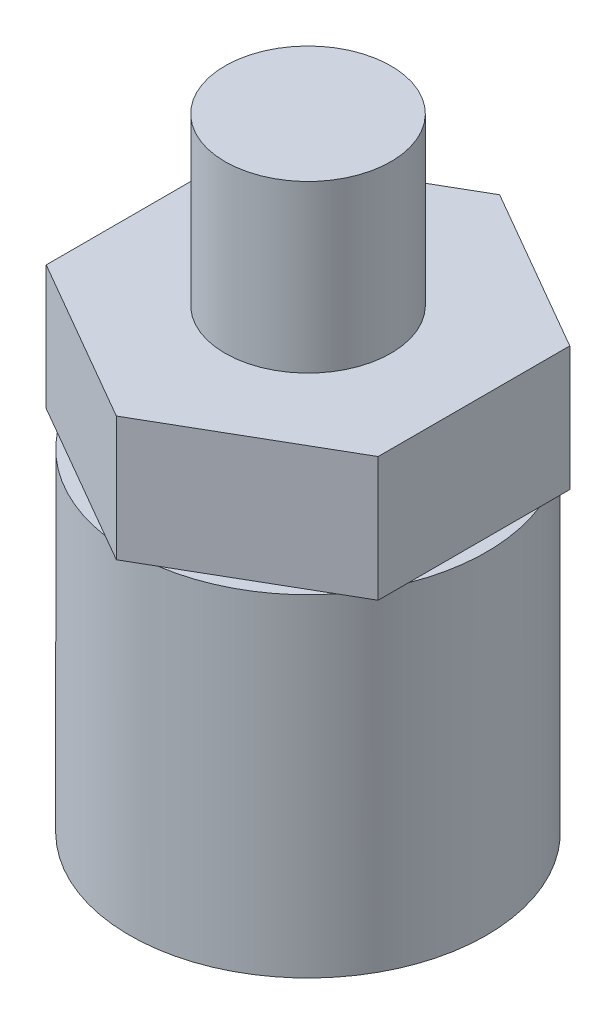
ISO-10303-21;
HEADER;
FILE_DESCRIPTION(('STEP AP214'),'2;1');
FILE_NAME('part.step','',(''),(''),'','','');
FILE_SCHEMA(('AUTOMOTIVE_DESIGN { 1 0 10303 214 1 1 1 1 }'));
ENDSEC;
DATA;
#1=APPLICATION_CONTEXT('core data for automotive mechanical design processes');
#2=APPLICATION_PROTOCOL_DEFINITION('international standard','automotive_design',2000,#1);
#3=PRODUCT_CONTEXT('',#1,'mechanical');
#4=PRODUCT('Part','Part','',(#3));
#5=PRODUCT_RELATED_PRODUCT_CATEGORY('part','',(#4));
#6=PRODUCT_DEFINITION_FORMATION('','',#4);
#7=PRODUCT_DEFINITION_CONTEXT('part definition',#1,'design');
#8=PRODUCT_DEFINITION('design','',#6,#7);
#9=PRODUCT_DEFINITION_SHAPE('','',#8);
#10=(LENGTH_UNIT() NAMED_UNIT(*) SI_UNIT(.MILLI.,.METRE.));
#11=(NAMED_UNIT(*) PLANE_ANGLE_UNIT() SI_UNIT($,.RADIAN.));
#12=(NAMED_UNIT(*) SI_UNIT($,.STERADIAN.) SOLID_ANGLE_UNIT());
#13=UNCERTAINTY_MEASURE_WITH_UNIT(LENGTH_MEASURE(1.E-05),#10,'distance_accuracy_value','');
#14=(GEOMETRIC_REPRESENTATION_CONTEXT(3) GLOBAL_UNCERTAINTY_ASSIGNED_CONTEXT((#13)) GLOBAL_UNIT_ASSIGNED_CONTEXT((#10,
#11,#12)) REPRESENTATION_CONTEXT('',''));
#15=CARTESIAN_POINT('',(0.,0.,0.));
#16=DIRECTION('',(0.,0.,1.));
#17=DIRECTION('',(1.,0.,0.));
#18=AXIS2_PLACEMENT_3D('',#15,#16,#17);
#19=CARTESIAN_POINT('',(0.,0.,0.));
#20=DIRECTION('',(0.,1.,0.));
#21=DIRECTION('',(0.,0.,1.));
#22=AXIS2_PLACEMENT_3D('',#19,#20,#21);
#23=PLANE('',#22);
#24=CARTESIAN_POINT('',(0.,0.,0.));
#25=DIRECTION('',(0.,-1.,0.));
#26=DIRECTION('',(0.,0.,-1.));
#27=AXIS2_PLACEMENT_3D('',#24,#25,#26);
#28=CIRCLE('',#27,4.3);
#29=CARTESIAN_POINT('',(3.36656503687163,0.,-2.6751149232348));
#30=VERTEX_POINT('',#29);
#31=CARTESIAN_POINT('',(4.,0.,-1.57797338380596));
#32=VERTEX_POINT('',#31);
#33=EDGE_CURVE('E41',#30,#32,#28,.T.);
#34=ORIENTED_EDGE('',*,*,#33,.F.);
#35=DIRECTION('',(-0.866025403784441,0.,-0.499999999999995));
#36=VECTOR('',#35,1.);
#37=CARTESIAN_POINT('',(3.99999999999999,0.,-2.30940107675852));
#38=LINE('',#37,#36);
#39=CARTESIAN_POINT('',(3.99999999999999,0.,-2.30940107675852));
#40=VERTEX_POINT('',#39);
#41=EDGE_CURVE('E132',#40,#30,#38,.T.);
#42=ORIENTED_EDGE('',*,*,#41,.F.);
#43=DIRECTION('',(0.,0.,-1.));
#44=VECTOR('',#43,1.);
#45=CARTESIAN_POINT('',(4.00000000000001,0.,2.3094010767585));
#46=LINE('',#45,#44);
#47=EDGE_CURVE('E226',#32,#40,#46,.T.);
#48=ORIENTED_EDGE('',*,*,#47,.F.);
#49=EDGE_LOOP('',(#34,#42,#48));
#50=FACE_BOUND('',#49,.T.);
#51=ADVANCED_FACE('F32',(#50),#23,.F.);
#52=CARTESIAN_POINT('',(4.00000000000001,0.,1.57797338380593));
#53=VERTEX_POINT('',#52);
#54=CARTESIAN_POINT('',(3.36656503687165,0.,2.67511492323478));
#55=VERTEX_POINT('',#54);
#56=EDGE_CURVE('E259',#53,#55,#28,.T.);
#57=ORIENTED_EDGE('',*,*,#56,.F.);
#58=CARTESIAN_POINT('',(4.00000000000001,0.,2.3094010767585));
#59=VERTEX_POINT('',#58);
#60=EDGE_CURVE('E144',#59,#53,#46,.T.);
#61=ORIENTED_EDGE('',*,*,#60,.F.);
#62=DIRECTION('',(0.866025403784438,0.,-0.500000000000001));
#63=VECTOR('',#62,1.);
#64=CARTESIAN_POINT('',(0.,0.,4.61880215351701));
#65=LINE('',#64,#63);
#66=EDGE_CURVE('E49',#55,#59,#65,.T.);
#67=ORIENTED_EDGE('',*,*,#66,.F.);
#68=EDGE_LOOP('',(#57,#61,#67));
#69=FACE_BOUND('',#68,.T.);
#70=ADVANCED_FACE('F279',(#69),#23,.F.);
#71=CARTESIAN_POINT('',(0.633434963128365,0.,4.25308830704073));
#72=VERTEX_POINT('',#71);
#73=CARTESIAN_POINT('',(-0.633434963128376,0.,4.25308830704073));
#74=VERTEX_POINT('',#73);
#75=EDGE_CURVE('E57',#72,#74,#28,.T.);
#76=ORIENTED_EDGE('',*,*,#75,.F.);
#77=CARTESIAN_POINT('',(0.,0.,4.61880215351701));
#78=VERTEX_POINT('',#77);
#79=EDGE_CURVE('E227',#78,#72,#65,.T.);
#80=ORIENTED_EDGE('',*,*,#79,.F.);
#81=DIRECTION('',(0.866025403784442,0.,0.499999999999995));
#82=VECTOR('',#81,1.);
#83=CARTESIAN_POINT('',(-3.99999999999998,0.,2.30940107675855));
#84=LINE('',#83,#82);
#85=EDGE_CURVE('E159',#74,#78,#84,.T.);
#86=ORIENTED_EDGE('',*,*,#85,.F.);
#87=EDGE_LOOP('',(#76,#80,#86));
#88=FACE_BOUND('',#87,.T.);
#89=ADVANCED_FACE('F285',(#88),#23,.F.);
#90=CARTESIAN_POINT('',(-3.3665650368716,0.,2.67511492323484));
#91=VERTEX_POINT('',#90);
#92=CARTESIAN_POINT('',(-3.99999999999999,0.,1.57797338380599));
#93=VERTEX_POINT('',#92);
#94=EDGE_CURVE('E257',#91,#93,#28,.T.);
#95=ORIENTED_EDGE('',*,*,#94,.F.);
#96=CARTESIAN_POINT('',(-3.99999999999998,0.,2.30940107675855));
#97=VERTEX_POINT('',#96);
#98=EDGE_CURVE('E230',#97,#91,#84,.T.);
#99=ORIENTED_EDGE('',*,*,#98,.F.);
#100=DIRECTION('',(0.,0.,1.));
#101=VECTOR('',#100,1.);
#102=CARTESIAN_POINT('',(-4.00000000000002,0.,-2.30940107675847));
#103=LINE('',#102,#101);
#104=EDGE_CURVE('E220',#93,#97,#103,.T.);
#105=ORIENTED_EDGE('',*,*,#104,.F.);
#106=EDGE_LOOP('',(#95,#99,#105));
#107=FACE_BOUND('',#106,.T.);
#108=ADVANCED_FACE('F255',(#107),#23,.F.);
#109=CARTESIAN_POINT('',(-4.00000000000002,0.,-1.5779733838059));
#110=VERTEX_POINT('',#109);
#111=CARTESIAN_POINT('',(-3.36656503687167,0.,-2.67511492323475));
#112=VERTEX_POINT('',#111);
#113=EDGE_CURVE('E153',#110,#112,#28,.T.);
#114=ORIENTED_EDGE('',*,*,#113,.F.);
#115=CARTESIAN_POINT('',(-4.00000000000002,0.,-2.30940107675847));
#116=VERTEX_POINT('',#115);
#117=EDGE_CURVE('E197',#116,#110,#103,.T.);
#118=ORIENTED_EDGE('',*,*,#117,.F.);
#119=DIRECTION('',(-0.866025403784434,0.,0.500000000000007));
#120=VECTOR('',#119,1.);
#121=CARTESIAN_POINT('',(0.,0.,-4.61880215351701));
#122=LINE('',#121,#120);
#123=EDGE_CURVE('E222',#112,#116,#122,.T.);
#124=ORIENTED_EDGE('',*,*,#123,.F.);
#125=EDGE_LOOP('',(#114,#118,#124));
#126=FACE_BOUND('',#125,.T.);
#127=ADVANCED_FACE('F262',(#126),#23,.F.);
#128=CARTESIAN_POINT('',(-3.99999999999998,3.,2.30940107675855));
#129=DIRECTION('',(0.499999999999995,0.,-0.866025403784441));
#130=DIRECTION('',(-0.866025403784442,0.,-0.499999999999995));
#131=AXIS2_PLACEMENT_3D('',#128,#129,#130);
#132=PLANE('',#131);
#133=ORIENTED_EDGE('',*,*,#98,.T.);
#134=EDGE_CURVE('E232',#91,#74,#84,.T.);
#135=ORIENTED_EDGE('',*,*,#134,.T.);
#136=ORIENTED_EDGE('',*,*,#85,.T.);
#137=DIRECTION('',(0.,-1.,0.));
#138=VECTOR('',#137,1.);
#139=CARTESIAN_POINT('',(0.,3.,4.61880215351701));
#140=LINE('',#139,#138);
#141=CARTESIAN_POINT('',(0.,3.,4.61880215351701));
#142=VERTEX_POINT('',#141);
#143=EDGE_CURVE('E36',#142,#78,#140,.T.);
#144=ORIENTED_EDGE('',*,*,#143,.F.);
#145=DIRECTION('',(0.866025403784442,0.,0.499999999999995));
#146=VECTOR('',#145,1.);
#147=CARTESIAN_POINT('',(-3.99999999999998,3.,2.30940107675855));
#148=LINE('',#147,#146);
#149=CARTESIAN_POINT('',(-3.99999999999998,3.,2.30940107675855));
#150=VERTEX_POINT('',#149);
#151=EDGE_CURVE('E188',#150,#142,#148,.T.);
#152=ORIENTED_EDGE('',*,*,#151,.F.);
#153=DIRECTION('',(0.,-1.,0.));
#154=VECTOR('',#153,1.);
#155=CARTESIAN_POINT('',(-3.99999999999998,3.,2.30940107675855));
#156=LINE('',#155,#154);
#157=EDGE_CURVE('E215',#150,#97,#156,.T.);
#158=ORIENTED_EDGE('',*,*,#157,.T.);
#159=EDGE_LOOP('',(#133,#135,#136,#144,#152,#158));
#160=FACE_BOUND('',#159,.T.);
#161=ADVANCED_FACE('F34',(#160),#132,.F.);
#162=CARTESIAN_POINT('',(0.,3.,4.61880215351701));
#163=DIRECTION('',(-0.500000000000001,0.,-0.866025403784438));
#164=DIRECTION('',(-0.866025403784438,0.,0.500000000000001));
#165=AXIS2_PLACEMENT_3D('',#162,#163,#164);
#166=PLANE('',#165);
#167=ORIENTED_EDGE('',*,*,#79,.T.);
#168=EDGE_CURVE('E229',#72,#55,#65,.T.);
#169=ORIENTED_EDGE('',*,*,#168,.T.);
#170=ORIENTED_EDGE('',*,*,#66,.T.);
#171=DIRECTION('',(0.,-1.,0.));
#172=VECTOR('',#171,1.);
#173=CARTESIAN_POINT('',(4.00000000000001,3.,2.3094010767585));
#174=LINE('',#173,#172);
#175=CARTESIAN_POINT('',(4.00000000000001,3.,2.3094010767585));
#176=VERTEX_POINT('',#175);
#177=EDGE_CURVE('E202',#176,#59,#174,.T.);
#178=ORIENTED_EDGE('',*,*,#177,.F.);
#179=DIRECTION('',(0.866025403784438,0.,-0.500000000000001));
#180=VECTOR('',#179,1.);
#181=CARTESIAN_POINT('',(0.,3.,4.61880215351701));
#182=LINE('',#181,#180);
#183=EDGE_CURVE('E190',#142,#176,#182,.T.);
#184=ORIENTED_EDGE('',*,*,#183,.F.);
#185=ORIENTED_EDGE('',*,*,#143,.T.);
#186=EDGE_LOOP('',(#167,#169,#170,#178,#184,#185));
#187=FACE_BOUND('',#186,.T.);
#188=ADVANCED_FACE('F295',(#187),#166,.F.);
#189=CARTESIAN_POINT('',(4.00000000000001,3.,2.3094010767585));
#190=DIRECTION('',(-1.,0.,0.));
#191=DIRECTION('',(0.,0.,1.));
#192=AXIS2_PLACEMENT_3D('',#189,#190,#191);
#193=PLANE('',#192);
#194=ORIENTED_EDGE('',*,*,#60,.T.);
#195=EDGE_CURVE('E225',#53,#32,#46,.T.);
#196=ORIENTED_EDGE('',*,*,#195,.T.);
#197=ORIENTED_EDGE('',*,*,#47,.T.);
#198=DIRECTION('',(0.,-1.,0.));
#199=VECTOR('',#198,1.);
#200=CARTESIAN_POINT('',(3.99999999999999,3.,-2.30940107675852));
#201=LINE('',#200,#199);
#202=CARTESIAN_POINT('',(3.99999999999999,3.,-2.30940107675852));
#203=VERTEX_POINT('',#202);
#204=EDGE_CURVE('E204',#203,#40,#201,.T.);
#205=ORIENTED_EDGE('',*,*,#204,.F.);
#206=DIRECTION('',(0.,0.,-1.));
#207=VECTOR('',#206,1.);
#208=CARTESIAN_POINT('',(4.00000000000001,3.,2.3094010767585));
#209=LINE('',#208,#207);
#210=EDGE_CURVE('E238',#176,#203,#209,.T.);
#211=ORIENTED_EDGE('',*,*,#210,.F.);
#212=ORIENTED_EDGE('',*,*,#177,.T.);
#213=EDGE_LOOP('',(#194,#196,#197,#205,#211,#212));
#214=FACE_BOUND('',#213,.T.);
#215=ADVANCED_FACE('F242',(#214),#193,.F.);
#216=CARTESIAN_POINT('',(3.99999999999999,3.,-2.30940107675852));
#217=DIRECTION('',(-0.499999999999995,0.,0.866025403784442));
#218=DIRECTION('',(0.866025403784442,0.,0.499999999999995));
#219=AXIS2_PLACEMENT_3D('',#216,#217,#218);
#220=PLANE('',#219);
#221=ORIENTED_EDGE('',*,*,#41,.T.);
#222=CARTESIAN_POINT('',(0.633434963128332,0.,-4.25308830704073));
#223=VERTEX_POINT('',#222);
#224=EDGE_CURVE('E124',#30,#223,#38,.T.);
#225=ORIENTED_EDGE('',*,*,#224,.T.);
#226=CARTESIAN_POINT('',(0.,0.,-4.61880215351701));
#227=VERTEX_POINT('',#226);
#228=EDGE_CURVE('E128',#223,#227,#38,.T.);
#229=ORIENTED_EDGE('',*,*,#228,.T.);
#230=DIRECTION('',(0.,-1.,0.));
#231=VECTOR('',#230,1.);
#232=CARTESIAN_POINT('',(0.,3.,-4.61880215351701));
#233=LINE('',#232,#231);
#234=CARTESIAN_POINT('',(0.,3.,-4.61880215351701));
#235=VERTEX_POINT('',#234);
#236=EDGE_CURVE('E208',#235,#227,#233,.T.);
#237=ORIENTED_EDGE('',*,*,#236,.F.);
#238=DIRECTION('',(-0.866025403784441,0.,-0.499999999999995));
#239=VECTOR('',#238,1.);
#240=CARTESIAN_POINT('',(3.99999999999999,3.,-2.30940107675852));
#241=LINE('',#240,#239);
#242=EDGE_CURVE('E236',#203,#235,#241,.T.);
#243=ORIENTED_EDGE('',*,*,#242,.F.);
#244=ORIENTED_EDGE('',*,*,#204,.T.);
#245=EDGE_LOOP('',(#221,#225,#229,#237,#243,#244));
#246=FACE_BOUND('',#245,.T.);
#247=ADVANCED_FACE('F126',(#246),#220,.F.);
#248=CARTESIAN_POINT('',(0.,3.,-4.61880215351701));
#249=DIRECTION('',(0.500000000000007,0.,0.866025403784435));
#250=DIRECTION('',(0.866025403784434,0.,-0.500000000000007));
#251=AXIS2_PLACEMENT_3D('',#248,#249,#250);
#252=PLANE('',#251);
#253=CARTESIAN_POINT('',(-0.633434963128392,0.,-4.25308830704072));
#254=VERTEX_POINT('',#253);
#255=EDGE_CURVE('E143',#227,#254,#122,.T.);
#256=ORIENTED_EDGE('',*,*,#255,.T.);
#257=EDGE_CURVE('E221',#254,#112,#122,.T.);
#258=ORIENTED_EDGE('',*,*,#257,.T.);
#259=ORIENTED_EDGE('',*,*,#123,.T.);
#260=DIRECTION('',(0.,-1.,0.));
#261=VECTOR('',#260,1.);
#262=CARTESIAN_POINT('',(-4.00000000000002,3.,-2.30940107675847));
#263=LINE('',#262,#261);
#264=CARTESIAN_POINT('',(-4.00000000000002,3.,-2.30940107675847));
#265=VERTEX_POINT('',#264);
#266=EDGE_CURVE('E212',#265,#116,#263,.T.);
#267=ORIENTED_EDGE('',*,*,#266,.F.);
#268=DIRECTION('',(-0.866025403784434,0.,0.500000000000007));
#269=VECTOR('',#268,1.);
#270=CARTESIAN_POINT('',(0.,3.,-4.61880215351701));
#271=LINE('',#270,#269);
#272=EDGE_CURVE('E234',#235,#265,#271,.T.);
#273=ORIENTED_EDGE('',*,*,#272,.F.);
#274=ORIENTED_EDGE('',*,*,#236,.T.);
#275=EDGE_LOOP('',(#256,#258,#259,#267,#273,#274));
#276=FACE_BOUND('',#275,.T.);
#277=ADVANCED_FACE('F247',(#276),#252,.F.);
#278=CARTESIAN_POINT('',(-4.00000000000002,3.,-2.30940107675847));
#279=DIRECTION('',(1.,0.,0.));
#280=DIRECTION('',(0.,0.,-1.));
#281=AXIS2_PLACEMENT_3D('',#278,#279,#280);
#282=PLANE('',#281);
#283=ORIENTED_EDGE('',*,*,#117,.T.);
#284=EDGE_CURVE('E219',#110,#93,#103,.T.);
#285=ORIENTED_EDGE('',*,*,#284,.T.);
#286=ORIENTED_EDGE('',*,*,#104,.T.);
#287=ORIENTED_EDGE('',*,*,#157,.F.);
#288=DIRECTION('',(0.,0.,1.));
#289=VECTOR('',#288,1.);
#290=CARTESIAN_POINT('',(-4.00000000000002,3.,-2.30940107675847));
#291=LINE('',#290,#289);
#292=EDGE_CURVE('E193',#265,#150,#291,.T.);
#293=ORIENTED_EDGE('',*,*,#292,.F.);
#294=ORIENTED_EDGE('',*,*,#266,.T.);
#295=EDGE_LOOP('',(#283,#285,#286,#287,#293,#294));
#296=FACE_BOUND('',#295,.T.);
#297=ADVANCED_FACE('F184',(#296),#282,.F.);
#298=CARTESIAN_POINT('',(0.,3.,0.));
#299=DIRECTION('',(0.,1.,0.));
#300=DIRECTION('',(0.,0.,1.));
#301=AXIS2_PLACEMENT_3D('',#298,#299,#300);
#302=PLANE('',#301);
#303=CARTESIAN_POINT('',(0.,3.,0.));
#304=DIRECTION('',(0.,1.,0.));
#305=DIRECTION('',(0.,0.,1.));
#306=AXIS2_PLACEMENT_3D('',#303,#304,#305);
#307=CIRCLE('',#306,2.);
#308=CARTESIAN_POINT('',(0.,3.,2.));
#309=VERTEX_POINT('',#308);
#310=EDGE_CURVE('E11',#309,#309,#307,.T.);
#311=ORIENTED_EDGE('',*,*,#310,.F.);
#312=EDGE_LOOP('',(#311));
#313=FACE_BOUND('',#312,.T.);
#314=ORIENTED_EDGE('',*,*,#151,.T.);
#315=ORIENTED_EDGE('',*,*,#183,.T.);
#316=ORIENTED_EDGE('',*,*,#210,.T.);
#317=ORIENTED_EDGE('',*,*,#242,.T.);
#318=ORIENTED_EDGE('',*,*,#272,.T.);
#319=ORIENTED_EDGE('',*,*,#292,.T.);
#320=EDGE_LOOP('',(#314,#315,#316,#317,#318,#319));
#321=FACE_BOUND('',#320,.T.);
#322=ADVANCED_FACE('F181',(#313,#321),#302,.T.);
#323=EDGE_CURVE('E141',#254,#223,#28,.T.);
#324=ORIENTED_EDGE('',*,*,#323,.F.);
#325=ORIENTED_EDGE('',*,*,#255,.F.);
#326=ORIENTED_EDGE('',*,*,#228,.F.);
#327=EDGE_LOOP('',(#324,#325,#326));
#328=FACE_BOUND('',#327,.T.);
#329=ADVANCED_FACE('F140',(#328),#23,.F.);
#330=CARTESIAN_POINT('',(0.,0.,0.));
#331=DIRECTION('',(0.,-1.,0.));
#332=DIRECTION('',(0.,0.,-1.));
#333=AXIS2_PLACEMENT_3D('',#330,#331,#332);
#334=PLANE('',#333);
#335=ORIENTED_EDGE('',*,*,#134,.F.);
#336=EDGE_CURVE('E167',#74,#91,#28,.T.);
#337=ORIENTED_EDGE('',*,*,#336,.F.);
#338=EDGE_LOOP('',(#335,#337));
#339=FACE_BOUND('',#338,.T.);
#340=ADVANCED_FACE('F268',(#339),#334,.F.);
#341=ORIENTED_EDGE('',*,*,#284,.F.);
#342=EDGE_CURVE('E164',#93,#110,#28,.T.);
#343=ORIENTED_EDGE('',*,*,#342,.F.);
#344=EDGE_LOOP('',(#341,#343));
#345=FACE_BOUND('',#344,.T.);
#346=ADVANCED_FACE('F265',(#345),#334,.F.);
#347=ORIENTED_EDGE('',*,*,#257,.F.);
#348=EDGE_CURVE('E152',#112,#254,#28,.T.);
#349=ORIENTED_EDGE('',*,*,#348,.F.);
#350=EDGE_LOOP('',(#347,#349));
#351=FACE_BOUND('',#350,.T.);
#352=ADVANCED_FACE('F267',(#351),#334,.F.);
#353=ORIENTED_EDGE('',*,*,#224,.F.);
#354=EDGE_CURVE('E149',#223,#30,#28,.T.);
#355=ORIENTED_EDGE('',*,*,#354,.F.);
#356=EDGE_LOOP('',(#353,#355));
#357=FACE_BOUND('',#356,.T.);
#358=ADVANCED_FACE('F155',(#357),#334,.F.);
#359=ORIENTED_EDGE('',*,*,#195,.F.);
#360=EDGE_CURVE('E157',#32,#53,#28,.T.);
#361=ORIENTED_EDGE('',*,*,#360,.F.);
#362=EDGE_LOOP('',(#359,#361));
#363=FACE_BOUND('',#362,.T.);
#364=ADVANCED_FACE('F333',(#363),#334,.F.);
#365=CARTESIAN_POINT('',(0.,-8.,0.));
#366=DIRECTION('',(0.,1.,0.));
#367=DIRECTION('',(0.,0.,1.));
#368=AXIS2_PLACEMENT_3D('',#365,#366,#367);
#369=CYLINDRICAL_SURFACE('',#368,4.3);
#370=CARTESIAN_POINT('',(0.,-8.,0.));
#371=DIRECTION('',(0.,-1.,0.));
#372=DIRECTION('',(0.,0.,-1.));
#373=AXIS2_PLACEMENT_3D('',#370,#371,#372);
#374=CIRCLE('',#373,4.3);
#375=CARTESIAN_POINT('',(0.,-8.,-4.3));
#376=VERTEX_POINT('',#375);
#377=EDGE_CURVE('E156',#376,#376,#374,.T.);
#378=ORIENTED_EDGE('',*,*,#377,.F.);
#379=EDGE_LOOP('',(#378));
#380=FACE_BOUND('',#379,.T.);
#381=ORIENTED_EDGE('',*,*,#354,.T.);
#382=ORIENTED_EDGE('',*,*,#33,.T.);
#383=ORIENTED_EDGE('',*,*,#360,.T.);
#384=ORIENTED_EDGE('',*,*,#56,.T.);
#385=EDGE_CURVE('E162',#55,#72,#28,.T.);
#386=ORIENTED_EDGE('',*,*,#385,.T.);
#387=ORIENTED_EDGE('',*,*,#75,.T.);
#388=ORIENTED_EDGE('',*,*,#336,.T.);
#389=ORIENTED_EDGE('',*,*,#94,.T.);
#390=ORIENTED_EDGE('',*,*,#342,.T.);
#391=ORIENTED_EDGE('',*,*,#113,.T.);
#392=ORIENTED_EDGE('',*,*,#348,.T.);
#393=ORIENTED_EDGE('',*,*,#323,.T.);
#394=EDGE_LOOP('',(#381,#382,#383,#384,#386,#387,#388,#389,#390,#391,#392,#393));
#395=FACE_BOUND('',#394,.T.);
#396=ADVANCED_FACE('F147',(#380,#395),#369,.T.);
#397=CARTESIAN_POINT('',(0.,-8.,0.));
#398=DIRECTION('',(0.,-1.,0.));
#399=DIRECTION('',(0.,0.,-1.));
#400=AXIS2_PLACEMENT_3D('',#397,#398,#399);
#401=PLANE('',#400);
#402=ORIENTED_EDGE('',*,*,#377,.T.);
#403=EDGE_LOOP('',(#402));
#404=FACE_BOUND('',#403,.T.);
#405=ADVANCED_FACE('F347',(#404),#401,.T.);
#406=ORIENTED_EDGE('',*,*,#168,.F.);
#407=ORIENTED_EDGE('',*,*,#385,.F.);
#408=EDGE_LOOP('',(#406,#407));
#409=FACE_BOUND('',#408,.T.);
#410=ADVANCED_FACE('F177',(#409),#334,.F.);
#411=CARTESIAN_POINT('',(0.,7.,0.));
#412=DIRECTION('',(0.,-1.,0.));
#413=DIRECTION('',(0.,0.,-1.));
#414=AXIS2_PLACEMENT_3D('',#411,#412,#413);
#415=CYLINDRICAL_SURFACE('',#414,2.);
#416=CARTESIAN_POINT('',(0.,7.,0.));
#417=DIRECTION('',(0.,1.,0.));
#418=DIRECTION('',(0.,0.,1.));
#419=AXIS2_PLACEMENT_3D('',#416,#417,#418);
#420=CIRCLE('',#419,2.);
#421=CARTESIAN_POINT('',(0.,7.,2.));
#422=VERTEX_POINT('',#421);
#423=EDGE_CURVE('E165',#422,#422,#420,.T.);
#424=ORIENTED_EDGE('',*,*,#423,.F.);
#425=EDGE_LOOP('',(#424));
#426=FACE_BOUND('',#425,.T.);
#427=ORIENTED_EDGE('',*,*,#310,.T.);
#428=EDGE_LOOP('',(#427));
#429=FACE_BOUND('',#428,.T.);
#430=ADVANCED_FACE('F174',(#426,#429),#415,.T.);
#431=CARTESIAN_POINT('',(0.,7.,0.));
#432=DIRECTION('',(0.,1.,0.));
#433=DIRECTION('',(0.,0.,1.));
#434=AXIS2_PLACEMENT_3D('',#431,#432,#433);
#435=PLANE('',#434);
#436=ORIENTED_EDGE('',*,*,#423,.T.);
#437=EDGE_LOOP('',(#436));
#438=FACE_BOUND('',#437,.T.);
#439=ADVANCED_FACE('F172',(#438),#435,.T.);
#440=CLOSED_SHELL('',(#51,#70,#89,#108,#127,#161,#188,#215,#247,#277,#297,#322,#329,#340,#346,
#352,#358,#364,#396,#405,#410,#430,#439));
#441=MANIFOLD_SOLID_BREP('B2',#440);
#442=ADVANCED_BREP_SHAPE_REPRESENTATION('',(#18,#441),#14);
#443=SHAPE_DEFINITION_REPRESENTATION(#9,#442);
ENDSEC;
END-ISO-10303-21;
